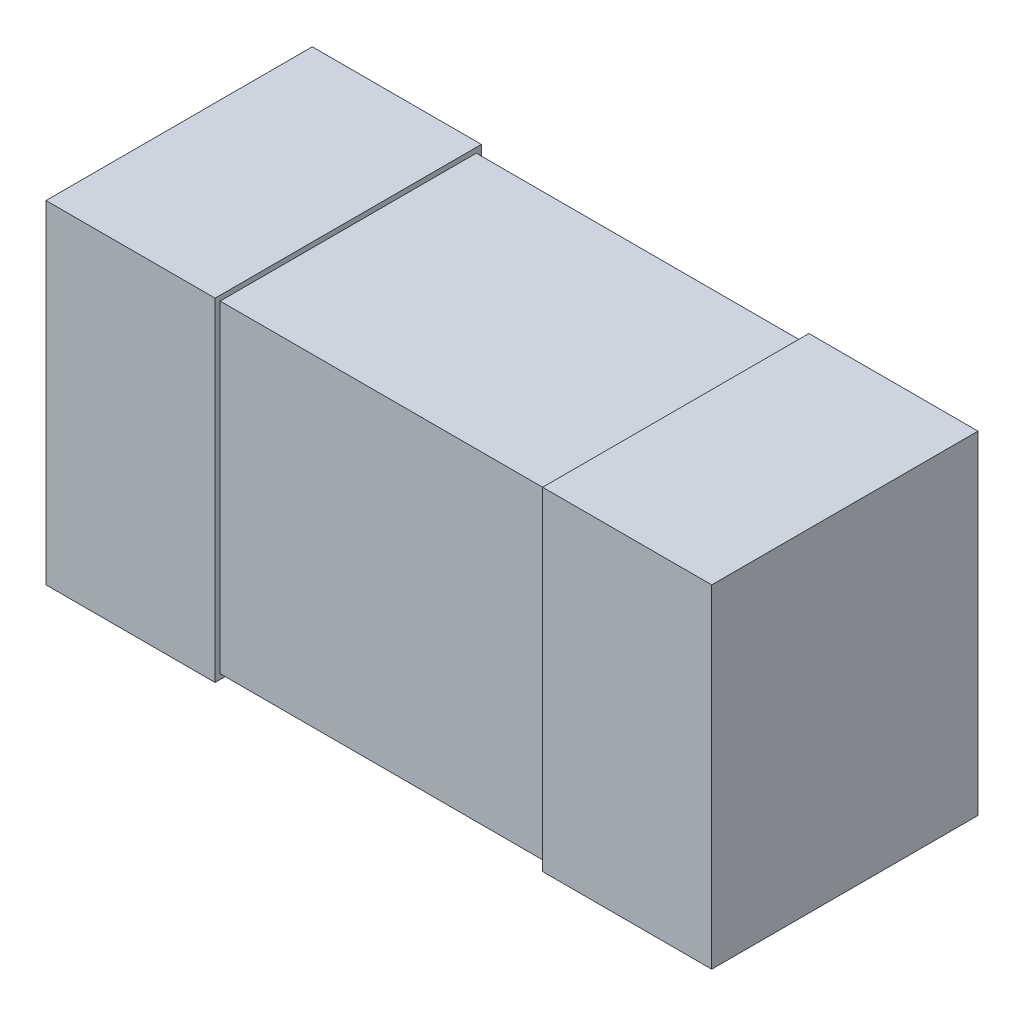
ISO-10303-21;
HEADER;
FILE_DESCRIPTION(('STEP AP214'),'2;1');
FILE_NAME('part.step','',(''),(''),'','','');
FILE_SCHEMA(('AUTOMOTIVE_DESIGN { 1 0 10303 214 1 1 1 1 }'));
ENDSEC;
DATA;
#1=APPLICATION_CONTEXT('core data for automotive mechanical design processes');
#2=APPLICATION_PROTOCOL_DEFINITION('international standard','automotive_design',2000,#1);
#3=PRODUCT_CONTEXT('',#1,'mechanical');
#4=PRODUCT('Part','Part','',(#3));
#5=PRODUCT_RELATED_PRODUCT_CATEGORY('part','',(#4));
#6=PRODUCT_DEFINITION_FORMATION('','',#4);
#7=PRODUCT_DEFINITION_CONTEXT('part definition',#1,'design');
#8=PRODUCT_DEFINITION('design','',#6,#7);
#9=PRODUCT_DEFINITION_SHAPE('','',#8);
#10=(LENGTH_UNIT() NAMED_UNIT(*) SI_UNIT(.MILLI.,.METRE.));
#11=(NAMED_UNIT(*) PLANE_ANGLE_UNIT() SI_UNIT($,.RADIAN.));
#12=(NAMED_UNIT(*) SI_UNIT($,.STERADIAN.) SOLID_ANGLE_UNIT());
#13=UNCERTAINTY_MEASURE_WITH_UNIT(LENGTH_MEASURE(1.E-05),#10,'distance_accuracy_value','');
#14=(GEOMETRIC_REPRESENTATION_CONTEXT(3) GLOBAL_UNCERTAINTY_ASSIGNED_CONTEXT((#13)) GLOBAL_UNIT_ASSIGNED_CONTEXT((#10,
#11,#12)) REPRESENTATION_CONTEXT('',''));
#15=CARTESIAN_POINT('',(0.,0.,0.));
#16=DIRECTION('',(0.,0.,1.));
#17=DIRECTION('',(1.,0.,0.));
#18=AXIS2_PLACEMENT_3D('',#15,#16,#17);
#19=CARTESIAN_POINT('',(0.5,-0.25,0.0762));
#20=DIRECTION('',(1.,0.,0.));
#21=DIRECTION('',(0.,1.,0.));
#22=AXIS2_PLACEMENT_3D('',#19,#20,#21);
#23=PLANE('',#22);
#24=DIRECTION('',(0.,1.,0.));
#25=VECTOR('',#24,1.);
#26=CARTESIAN_POINT('',(0.5,-0.25,0.0762));
#27=LINE('',#26,#25);
#28=CARTESIAN_POINT('',(0.5,-0.25,0.0762));
#29=VERTEX_POINT('',#28);
#30=CARTESIAN_POINT('',(0.5,0.25,0.0762));
#31=VERTEX_POINT('',#30);
#32=EDGE_CURVE('E164',#29,#31,#27,.T.);
#33=ORIENTED_EDGE('',*,*,#32,.T.);
#34=DIRECTION('',(0.,0.,1.));
#35=VECTOR('',#34,1.);
#36=CARTESIAN_POINT('',(0.5,0.25,0.0762));
#37=LINE('',#36,#35);
#38=CARTESIAN_POINT('',(0.5,0.25,0.4762));
#39=VERTEX_POINT('',#38);
#40=EDGE_CURVE('E215',#31,#39,#37,.T.);
#41=ORIENTED_EDGE('',*,*,#40,.T.);
#42=DIRECTION('',(0.,1.,0.));
#43=VECTOR('',#42,1.);
#44=CARTESIAN_POINT('',(0.5,-0.25,0.4762));
#45=LINE('',#44,#43);
#46=CARTESIAN_POINT('',(0.5,-0.25,0.4762));
#47=VERTEX_POINT('',#46);
#48=EDGE_CURVE('E139',#47,#39,#45,.T.);
#49=ORIENTED_EDGE('',*,*,#48,.F.);
#50=DIRECTION('',(0.,0.,1.));
#51=VECTOR('',#50,1.);
#52=CARTESIAN_POINT('',(0.5,-0.25,0.0762));
#53=LINE('',#52,#51);
#54=EDGE_CURVE('E11',#29,#47,#53,.T.);
#55=ORIENTED_EDGE('',*,*,#54,.F.);
#56=EDGE_LOOP('',(#33,#41,#49,#55));
#57=FACE_BOUND('',#56,.T.);
#58=ADVANCED_FACE('F16',(#57),#23,.T.);
#59=CARTESIAN_POINT('',(-0.5,0.25,0.0762));
#60=DIRECTION('',(-1.,0.,0.));
#61=DIRECTION('',(0.,0.,1.));
#62=AXIS2_PLACEMENT_3D('',#59,#60,#61);
#63=PLANE('',#62);
#64=DIRECTION('',(0.,-1.,0.));
#65=VECTOR('',#64,1.);
#66=CARTESIAN_POINT('',(-0.5,0.25,0.0762));
#67=LINE('',#66,#65);
#68=CARTESIAN_POINT('',(-0.5,0.25,0.0762));
#69=VERTEX_POINT('',#68);
#70=CARTESIAN_POINT('',(-0.5,-0.25,0.0762));
#71=VERTEX_POINT('',#70);
#72=EDGE_CURVE('E142',#69,#71,#67,.T.);
#73=ORIENTED_EDGE('',*,*,#72,.T.);
#74=DIRECTION('',(0.,0.,1.));
#75=VECTOR('',#74,1.);
#76=CARTESIAN_POINT('',(-0.5,-0.25,0.0762));
#77=LINE('',#76,#75);
#78=CARTESIAN_POINT('',(-0.5,-0.25,0.4762));
#79=VERTEX_POINT('',#78);
#80=EDGE_CURVE('E27',#71,#79,#77,.T.);
#81=ORIENTED_EDGE('',*,*,#80,.T.);
#82=DIRECTION('',(0.,-1.,0.));
#83=VECTOR('',#82,1.);
#84=CARTESIAN_POINT('',(-0.5,0.25,0.4762));
#85=LINE('',#84,#83);
#86=CARTESIAN_POINT('',(-0.5,0.25,0.4762));
#87=VERTEX_POINT('',#86);
#88=EDGE_CURVE('E182',#87,#79,#85,.T.);
#89=ORIENTED_EDGE('',*,*,#88,.F.);
#90=DIRECTION('',(0.,0.,1.));
#91=VECTOR('',#90,1.);
#92=CARTESIAN_POINT('',(-0.5,0.25,0.0762));
#93=LINE('',#92,#91);
#94=EDGE_CURVE('E144',#69,#87,#93,.T.);
#95=ORIENTED_EDGE('',*,*,#94,.F.);
#96=EDGE_LOOP('',(#73,#81,#89,#95));
#97=FACE_BOUND('',#96,.T.);
#98=ADVANCED_FACE('F18',(#97),#63,.T.);
#99=CARTESIAN_POINT('',(-0.5,-0.25,0.0762));
#100=DIRECTION('',(0.,-1.,0.));
#101=DIRECTION('',(0.,0.,-1.));
#102=AXIS2_PLACEMENT_3D('',#99,#100,#101);
#103=PLANE('',#102);
#104=DIRECTION('',(0.,0.,1.));
#105=VECTOR('',#104,1.);
#106=CARTESIAN_POINT('',(0.246,-0.25,0.0762));
#107=LINE('',#106,#105);
#108=CARTESIAN_POINT('',(0.246,-0.25,0.0762));
#109=VERTEX_POINT('',#108);
#110=CARTESIAN_POINT('',(0.246,-0.25,0.4762));
#111=VERTEX_POINT('',#110);
#112=EDGE_CURVE('E188',#109,#111,#107,.T.);
#113=ORIENTED_EDGE('',*,*,#112,.F.);
#114=DIRECTION('',(1.,0.,0.));
#115=VECTOR('',#114,1.);
#116=CARTESIAN_POINT('',(0.246,-0.25,0.0762));
#117=LINE('',#116,#115);
#118=EDGE_CURVE('E161',#109,#29,#117,.T.);
#119=ORIENTED_EDGE('',*,*,#118,.T.);
#120=ORIENTED_EDGE('',*,*,#54,.T.);
#121=DIRECTION('',(1.,0.,0.));
#122=VECTOR('',#121,1.);
#123=CARTESIAN_POINT('',(0.246,-0.25,0.4762));
#124=LINE('',#123,#122);
#125=EDGE_CURVE('E170',#111,#47,#124,.T.);
#126=ORIENTED_EDGE('',*,*,#125,.F.);
#127=EDGE_LOOP('',(#113,#119,#120,#126));
#128=FACE_BOUND('',#127,.T.);
#129=ADVANCED_FACE('F280',(#128),#103,.T.);
#130=CARTESIAN_POINT('',(-0.5,-0.25,0.0762));
#131=DIRECTION('',(0.,-1.,0.));
#132=DIRECTION('',(0.,0.,-1.));
#133=AXIS2_PLACEMENT_3D('',#130,#131,#132);
#134=PLANE('',#133);
#135=DIRECTION('',(0.,0.,1.));
#136=VECTOR('',#135,1.);
#137=CARTESIAN_POINT('',(-0.246,-0.25,0.0762));
#138=LINE('',#137,#136);
#139=CARTESIAN_POINT('',(-0.246,-0.25,0.0762));
#140=VERTEX_POINT('',#139);
#141=CARTESIAN_POINT('',(-0.246,-0.25,0.4762));
#142=VERTEX_POINT('',#141);
#143=EDGE_CURVE('E245',#140,#142,#138,.T.);
#144=ORIENTED_EDGE('',*,*,#143,.T.);
#145=DIRECTION('',(1.,0.,0.));
#146=VECTOR('',#145,1.);
#147=CARTESIAN_POINT('',(-0.5,-0.25,0.4762));
#148=LINE('',#147,#146);
#149=EDGE_CURVE('E135',#79,#142,#148,.T.);
#150=ORIENTED_EDGE('',*,*,#149,.F.);
#151=ORIENTED_EDGE('',*,*,#80,.F.);
#152=DIRECTION('',(1.,0.,0.));
#153=VECTOR('',#152,1.);
#154=CARTESIAN_POINT('',(-0.5,-0.25,0.0762));
#155=LINE('',#154,#153);
#156=EDGE_CURVE('E133',#71,#140,#155,.T.);
#157=ORIENTED_EDGE('',*,*,#156,.T.);
#158=EDGE_LOOP('',(#144,#150,#151,#157));
#159=FACE_BOUND('',#158,.T.);
#160=ADVANCED_FACE('F131',(#159),#134,.T.);
#161=CARTESIAN_POINT('',(0.,0.,0.4762));
#162=DIRECTION('',(0.,0.,1.));
#163=DIRECTION('',(1.,0.,0.));
#164=AXIS2_PLACEMENT_3D('',#161,#162,#163);
#165=PLANE('',#164);
#166=DIRECTION('',(0.,1.,0.));
#167=VECTOR('',#166,1.);
#168=CARTESIAN_POINT('',(0.246,-0.25,0.4762));
#169=LINE('',#168,#167);
#170=CARTESIAN_POINT('',(0.246,0.25,0.4762));
#171=VERTEX_POINT('',#170);
#172=EDGE_CURVE('E183',#111,#171,#169,.T.);
#173=ORIENTED_EDGE('',*,*,#172,.F.);
#174=ORIENTED_EDGE('',*,*,#125,.T.);
#175=ORIENTED_EDGE('',*,*,#48,.T.);
#176=DIRECTION('',(-1.,0.,0.));
#177=VECTOR('',#176,1.);
#178=CARTESIAN_POINT('',(0.5,0.25,0.4762));
#179=LINE('',#178,#177);
#180=EDGE_CURVE('E219',#39,#171,#179,.T.);
#181=ORIENTED_EDGE('',*,*,#180,.T.);
#182=EDGE_LOOP('',(#173,#174,#175,#181));
#183=FACE_BOUND('',#182,.T.);
#184=ADVANCED_FACE('F274',(#183),#165,.T.);
#185=CARTESIAN_POINT('',(0.,0.,0.4762));
#186=DIRECTION('',(0.,0.,1.));
#187=DIRECTION('',(1.,0.,0.));
#188=AXIS2_PLACEMENT_3D('',#185,#186,#187);
#189=PLANE('',#188);
#190=DIRECTION('',(0.,1.,0.));
#191=VECTOR('',#190,1.);
#192=CARTESIAN_POINT('',(-0.246,-0.25,0.4762));
#193=LINE('',#192,#191);
#194=CARTESIAN_POINT('',(-0.246,0.25,0.4762));
#195=VERTEX_POINT('',#194);
#196=EDGE_CURVE('E211',#142,#195,#193,.T.);
#197=ORIENTED_EDGE('',*,*,#196,.T.);
#198=DIRECTION('',(-1.,0.,0.));
#199=VECTOR('',#198,1.);
#200=CARTESIAN_POINT('',(-0.246,0.25,0.4762));
#201=LINE('',#200,#199);
#202=EDGE_CURVE('E223',#195,#87,#201,.T.);
#203=ORIENTED_EDGE('',*,*,#202,.T.);
#204=ORIENTED_EDGE('',*,*,#88,.T.);
#205=ORIENTED_EDGE('',*,*,#149,.T.);
#206=EDGE_LOOP('',(#197,#203,#204,#205));
#207=FACE_BOUND('',#206,.T.);
#208=ADVANCED_FACE('F309',(#207),#189,.T.);
#209=CARTESIAN_POINT('',(0.5,0.25,0.0762));
#210=DIRECTION('',(0.,1.,0.));
#211=DIRECTION('',(1.,0.,0.));
#212=AXIS2_PLACEMENT_3D('',#209,#210,#211);
#213=PLANE('',#212);
#214=DIRECTION('',(0.,0.,1.));
#215=VECTOR('',#214,1.);
#216=CARTESIAN_POINT('',(0.246,0.25,0.0762));
#217=LINE('',#216,#215);
#218=CARTESIAN_POINT('',(0.246,0.25,0.0762));
#219=VERTEX_POINT('',#218);
#220=EDGE_CURVE('E187',#219,#171,#217,.T.);
#221=ORIENTED_EDGE('',*,*,#220,.T.);
#222=ORIENTED_EDGE('',*,*,#180,.F.);
#223=ORIENTED_EDGE('',*,*,#40,.F.);
#224=DIRECTION('',(-1.,0.,0.));
#225=VECTOR('',#224,1.);
#226=CARTESIAN_POINT('',(0.5,0.25,0.0762));
#227=LINE('',#226,#225);
#228=EDGE_CURVE('E169',#31,#219,#227,.T.);
#229=ORIENTED_EDGE('',*,*,#228,.T.);
#230=EDGE_LOOP('',(#221,#222,#223,#229));
#231=FACE_BOUND('',#230,.T.);
#232=ADVANCED_FACE('F267',(#231),#213,.T.);
#233=CARTESIAN_POINT('',(0.5,0.25,0.0762));
#234=DIRECTION('',(0.,1.,0.));
#235=DIRECTION('',(1.,0.,0.));
#236=AXIS2_PLACEMENT_3D('',#233,#234,#235);
#237=PLANE('',#236);
#238=DIRECTION('',(0.,0.,1.));
#239=VECTOR('',#238,1.);
#240=CARTESIAN_POINT('',(-0.246,0.25,0.0762));
#241=LINE('',#240,#239);
#242=CARTESIAN_POINT('',(-0.246,0.25,0.0762));
#243=VERTEX_POINT('',#242);
#244=EDGE_CURVE('E163',#243,#195,#241,.T.);
#245=ORIENTED_EDGE('',*,*,#244,.F.);
#246=DIRECTION('',(-1.,0.,0.));
#247=VECTOR('',#246,1.);
#248=CARTESIAN_POINT('',(-0.246,0.25,0.0762));
#249=LINE('',#248,#247);
#250=EDGE_CURVE('E149',#243,#69,#249,.T.);
#251=ORIENTED_EDGE('',*,*,#250,.T.);
#252=ORIENTED_EDGE('',*,*,#94,.T.);
#253=ORIENTED_EDGE('',*,*,#202,.F.);
#254=EDGE_LOOP('',(#245,#251,#252,#253));
#255=FACE_BOUND('',#254,.T.);
#256=ADVANCED_FACE('F296',(#255),#237,.T.);
#257=CARTESIAN_POINT('',(0.246,-0.25,0.08382));
#258=DIRECTION('',(1.,0.,0.));
#259=DIRECTION('',(0.,1.,0.));
#260=AXIS2_PLACEMENT_3D('',#257,#258,#259);
#261=PLANE('',#260);
#262=DIRECTION('',(0.,1.,0.));
#263=VECTOR('',#262,1.);
#264=CARTESIAN_POINT('',(0.246,-0.24238,0.08382));
#265=LINE('',#264,#263);
#266=CARTESIAN_POINT('',(0.246,-0.24238,0.08382));
#267=VERTEX_POINT('',#266);
#268=CARTESIAN_POINT('',(0.246,0.24238,0.08382));
#269=VERTEX_POINT('',#268);
#270=EDGE_CURVE('E197',#267,#269,#265,.T.);
#271=ORIENTED_EDGE('',*,*,#270,.T.);
#272=DIRECTION('',(0.,0.,1.));
#273=VECTOR('',#272,1.);
#274=CARTESIAN_POINT('',(0.246,0.24238,0.08382));
#275=LINE('',#274,#273);
#276=CARTESIAN_POINT('',(0.246,0.24238,0.46858));
#277=VERTEX_POINT('',#276);
#278=EDGE_CURVE('E200',#269,#277,#275,.T.);
#279=ORIENTED_EDGE('',*,*,#278,.T.);
#280=DIRECTION('',(0.,-1.,0.));
#281=VECTOR('',#280,1.);
#282=CARTESIAN_POINT('',(0.246,0.24238,0.46858));
#283=LINE('',#282,#281);
#284=CARTESIAN_POINT('',(0.246,-0.24238,0.46858));
#285=VERTEX_POINT('',#284);
#286=EDGE_CURVE('E203',#277,#285,#283,.T.);
#287=ORIENTED_EDGE('',*,*,#286,.T.);
#288=DIRECTION('',(0.,0.,-1.));
#289=VECTOR('',#288,1.);
#290=CARTESIAN_POINT('',(0.246,-0.24238,0.46858));
#291=LINE('',#290,#289);
#292=EDGE_CURVE('E193',#285,#267,#291,.T.);
#293=ORIENTED_EDGE('',*,*,#292,.T.);
#294=EDGE_LOOP('',(#271,#279,#287,#293));
#295=FACE_BOUND('',#294,.T.);
#296=DIRECTION('',(0.,1.,0.));
#297=VECTOR('',#296,1.);
#298=CARTESIAN_POINT('',(0.246,-0.25,0.0762));
#299=LINE('',#298,#297);
#300=EDGE_CURVE('E165',#109,#219,#299,.T.);
#301=ORIENTED_EDGE('',*,*,#300,.F.);
#302=ORIENTED_EDGE('',*,*,#112,.T.);
#303=ORIENTED_EDGE('',*,*,#172,.T.);
#304=ORIENTED_EDGE('',*,*,#220,.F.);
#305=EDGE_LOOP('',(#301,#302,#303,#304));
#306=FACE_BOUND('',#305,.T.);
#307=ADVANCED_FACE('F272',(#295,#306),#261,.F.);
#308=CARTESIAN_POINT('',(-0.246,-0.25,0.08382));
#309=DIRECTION('',(0.,0.,1.));
#310=DIRECTION('',(1.,0.,0.));
#311=AXIS2_PLACEMENT_3D('',#308,#309,#310);
#312=PLANE('',#311);
#313=DIRECTION('',(1.,0.,0.));
#314=VECTOR('',#313,1.);
#315=CARTESIAN_POINT('',(-0.246,-0.24238,0.08382));
#316=LINE('',#315,#314);
#317=CARTESIAN_POINT('',(-0.246,-0.24238,0.08382));
#318=VERTEX_POINT('',#317);
#319=EDGE_CURVE('E189',#318,#267,#316,.T.);
#320=ORIENTED_EDGE('',*,*,#319,.F.);
#321=DIRECTION('',(0.,1.,0.));
#322=VECTOR('',#321,1.);
#323=CARTESIAN_POINT('',(-0.246,-0.24238,0.08382));
#324=LINE('',#323,#322);
#325=CARTESIAN_POINT('',(-0.246,0.24238,0.08382));
#326=VERTEX_POINT('',#325);
#327=EDGE_CURVE('E178',#318,#326,#324,.T.);
#328=ORIENTED_EDGE('',*,*,#327,.T.);
#329=DIRECTION('',(1.,0.,0.));
#330=VECTOR('',#329,1.);
#331=CARTESIAN_POINT('',(-0.246,0.24238,0.08382));
#332=LINE('',#331,#330);
#333=EDGE_CURVE('E206',#326,#269,#332,.T.);
#334=ORIENTED_EDGE('',*,*,#333,.T.);
#335=ORIENTED_EDGE('',*,*,#270,.F.);
#336=EDGE_LOOP('',(#320,#328,#334,#335));
#337=FACE_BOUND('',#336,.T.);
#338=ADVANCED_FACE('F304',(#337),#312,.F.);
#339=CARTESIAN_POINT('',(-0.246,0.24238,0.0762));
#340=DIRECTION('',(0.,-1.,0.));
#341=DIRECTION('',(0.,0.,-1.));
#342=AXIS2_PLACEMENT_3D('',#339,#340,#341);
#343=PLANE('',#342);
#344=ORIENTED_EDGE('',*,*,#333,.F.);
#345=DIRECTION('',(0.,0.,1.));
#346=VECTOR('',#345,1.);
#347=CARTESIAN_POINT('',(-0.246,0.24238,0.08382));
#348=LINE('',#347,#346);
#349=CARTESIAN_POINT('',(-0.246,0.24238,0.46858));
#350=VERTEX_POINT('',#349);
#351=EDGE_CURVE('E174',#326,#350,#348,.T.);
#352=ORIENTED_EDGE('',*,*,#351,.T.);
#353=DIRECTION('',(1.,0.,0.));
#354=VECTOR('',#353,1.);
#355=CARTESIAN_POINT('',(-0.246,0.24238,0.46858));
#356=LINE('',#355,#354);
#357=EDGE_CURVE('E207',#350,#277,#356,.T.);
#358=ORIENTED_EDGE('',*,*,#357,.T.);
#359=ORIENTED_EDGE('',*,*,#278,.F.);
#360=EDGE_LOOP('',(#344,#352,#358,#359));
#361=FACE_BOUND('',#360,.T.);
#362=ADVANCED_FACE('F307',(#361),#343,.F.);
#363=CARTESIAN_POINT('',(-0.246,0.25,0.46858));
#364=DIRECTION('',(0.,0.,-1.));
#365=DIRECTION('',(0.,-1.,0.));
#366=AXIS2_PLACEMENT_3D('',#363,#364,#365);
#367=PLANE('',#366);
#368=ORIENTED_EDGE('',*,*,#357,.F.);
#369=DIRECTION('',(0.,-1.,0.));
#370=VECTOR('',#369,1.);
#371=CARTESIAN_POINT('',(-0.246,0.24238,0.46858));
#372=LINE('',#371,#370);
#373=CARTESIAN_POINT('',(-0.246,-0.24238,0.46858));
#374=VERTEX_POINT('',#373);
#375=EDGE_CURVE('E179',#350,#374,#372,.T.);
#376=ORIENTED_EDGE('',*,*,#375,.T.);
#377=DIRECTION('',(1.,0.,0.));
#378=VECTOR('',#377,1.);
#379=CARTESIAN_POINT('',(-0.246,-0.24238,0.46858));
#380=LINE('',#379,#378);
#381=EDGE_CURVE('E20',#374,#285,#380,.T.);
#382=ORIENTED_EDGE('',*,*,#381,.T.);
#383=ORIENTED_EDGE('',*,*,#286,.F.);
#384=EDGE_LOOP('',(#368,#376,#382,#383));
#385=FACE_BOUND('',#384,.T.);
#386=ADVANCED_FACE('F301',(#385),#367,.F.);
#387=CARTESIAN_POINT('',(-0.246,-0.24238,0.4762));
#388=DIRECTION('',(0.,1.,0.));
#389=DIRECTION('',(1.,0.,0.));
#390=AXIS2_PLACEMENT_3D('',#387,#388,#389);
#391=PLANE('',#390);
#392=ORIENTED_EDGE('',*,*,#381,.F.);
#393=DIRECTION('',(0.,0.,-1.));
#394=VECTOR('',#393,1.);
#395=CARTESIAN_POINT('',(-0.246,-0.24238,0.46858));
#396=LINE('',#395,#394);
#397=EDGE_CURVE('E248',#374,#318,#396,.T.);
#398=ORIENTED_EDGE('',*,*,#397,.T.);
#399=ORIENTED_EDGE('',*,*,#319,.T.);
#400=ORIENTED_EDGE('',*,*,#292,.F.);
#401=EDGE_LOOP('',(#392,#398,#399,#400));
#402=FACE_BOUND('',#401,.T.);
#403=ADVANCED_FACE('F298',(#402),#391,.F.);
#404=CARTESIAN_POINT('',(-0.246,-0.25,0.0762));
#405=DIRECTION('',(-1.,0.,0.));
#406=DIRECTION('',(0.,0.,1.));
#407=AXIS2_PLACEMENT_3D('',#404,#405,#406);
#408=PLANE('',#407);
#409=ORIENTED_EDGE('',*,*,#397,.F.);
#410=ORIENTED_EDGE('',*,*,#375,.F.);
#411=ORIENTED_EDGE('',*,*,#351,.F.);
#412=ORIENTED_EDGE('',*,*,#327,.F.);
#413=EDGE_LOOP('',(#409,#410,#411,#412));
#414=FACE_BOUND('',#413,.T.);
#415=DIRECTION('',(0.,1.,0.));
#416=VECTOR('',#415,1.);
#417=CARTESIAN_POINT('',(-0.246,-0.25,0.0762));
#418=LINE('',#417,#416);
#419=EDGE_CURVE('E153',#140,#243,#418,.T.);
#420=ORIENTED_EDGE('',*,*,#419,.T.);
#421=ORIENTED_EDGE('',*,*,#244,.T.);
#422=ORIENTED_EDGE('',*,*,#196,.F.);
#423=ORIENTED_EDGE('',*,*,#143,.F.);
#424=EDGE_LOOP('',(#420,#421,#422,#423));
#425=FACE_BOUND('',#424,.T.);
#426=ADVANCED_FACE('F300',(#414,#425),#408,.F.);
#427=CARTESIAN_POINT('',(0.,0.,0.0762));
#428=DIRECTION('',(0.,0.,1.));
#429=DIRECTION('',(1.,0.,0.));
#430=AXIS2_PLACEMENT_3D('',#427,#428,#429);
#431=PLANE('',#430);
#432=ORIENTED_EDGE('',*,*,#300,.T.);
#433=ORIENTED_EDGE('',*,*,#228,.F.);
#434=ORIENTED_EDGE('',*,*,#32,.F.);
#435=ORIENTED_EDGE('',*,*,#118,.F.);
#436=EDGE_LOOP('',(#432,#433,#434,#435));
#437=FACE_BOUND('',#436,.T.);
#438=ADVANCED_FACE('F279',(#437),#431,.F.);
#439=CARTESIAN_POINT('',(0.,0.,0.0762));
#440=DIRECTION('',(0.,0.,1.));
#441=DIRECTION('',(1.,0.,0.));
#442=AXIS2_PLACEMENT_3D('',#439,#440,#441);
#443=PLANE('',#442);
#444=ORIENTED_EDGE('',*,*,#419,.F.);
#445=ORIENTED_EDGE('',*,*,#156,.F.);
#446=ORIENTED_EDGE('',*,*,#72,.F.);
#447=ORIENTED_EDGE('',*,*,#250,.F.);
#448=EDGE_LOOP('',(#444,#445,#446,#447));
#449=FACE_BOUND('',#448,.T.);
#450=ADVANCED_FACE('F151',(#449),#443,.F.);
#451=CLOSED_SHELL('',(#58,#98,#129,#160,#184,#208,#232,#256,#307,#338,#362,#386,#403,#426,#438,#450));
#452=MANIFOLD_SOLID_BREP('B1',#451);
#453=ADVANCED_BREP_SHAPE_REPRESENTATION('',(#18,#452),#14);
#454=SHAPE_DEFINITION_REPRESENTATION(#9,#453);
ENDSEC;
END-ISO-10303-21;
